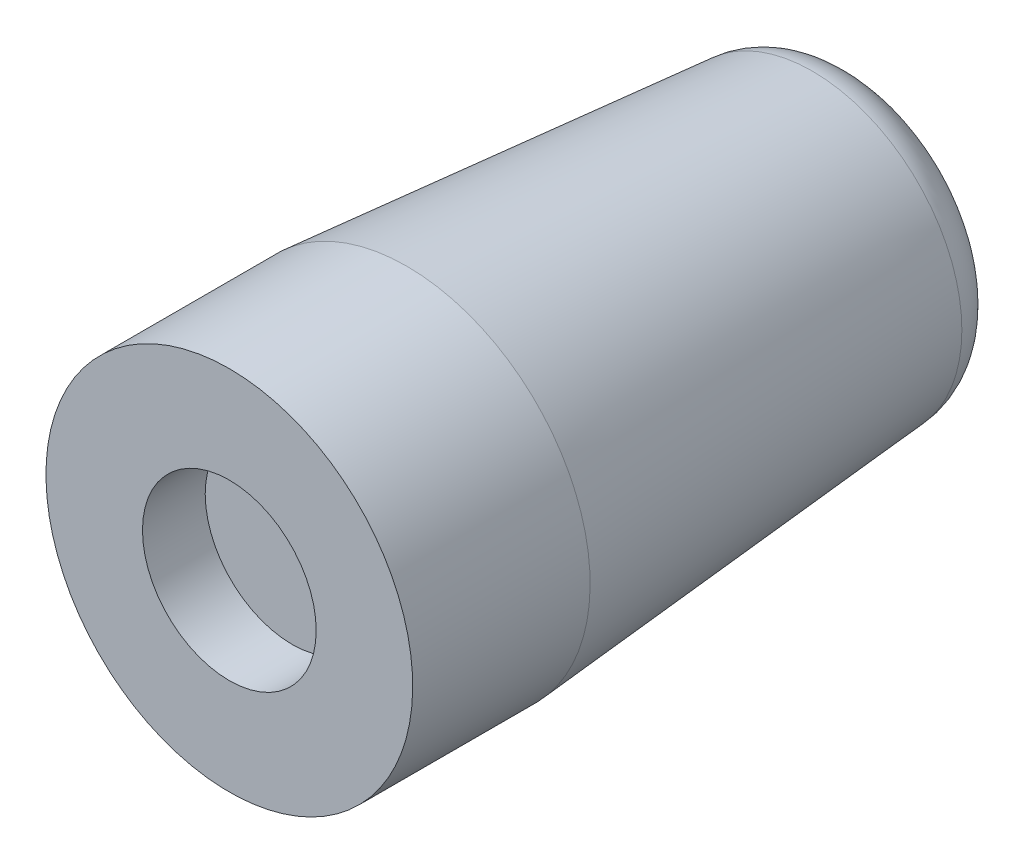
ISO-10303-21;
HEADER;
FILE_DESCRIPTION(('STEP AP214'),'2;1');
FILE_NAME('part.step','',(''),(''),'','','');
FILE_SCHEMA(('AUTOMOTIVE_DESIGN { 1 0 10303 214 1 1 1 1 }'));
ENDSEC;
DATA;
#1=APPLICATION_CONTEXT('core data for automotive mechanical design processes');
#2=APPLICATION_PROTOCOL_DEFINITION('international standard','automotive_design',2000,#1);
#3=PRODUCT_CONTEXT('',#1,'mechanical');
#4=PRODUCT('Part','Part','',(#3));
#5=PRODUCT_RELATED_PRODUCT_CATEGORY('part','',(#4));
#6=PRODUCT_DEFINITION_FORMATION('','',#4);
#7=PRODUCT_DEFINITION_CONTEXT('part definition',#1,'design');
#8=PRODUCT_DEFINITION('design','',#6,#7);
#9=PRODUCT_DEFINITION_SHAPE('','',#8);
#10=(LENGTH_UNIT() NAMED_UNIT(*) SI_UNIT(.MILLI.,.METRE.));
#11=(NAMED_UNIT(*) PLANE_ANGLE_UNIT() SI_UNIT($,.RADIAN.));
#12=(NAMED_UNIT(*) SI_UNIT($,.STERADIAN.) SOLID_ANGLE_UNIT());
#13=UNCERTAINTY_MEASURE_WITH_UNIT(LENGTH_MEASURE(1.E-05),#10,'distance_accuracy_value','');
#14=(GEOMETRIC_REPRESENTATION_CONTEXT(3) GLOBAL_UNCERTAINTY_ASSIGNED_CONTEXT((#13)) GLOBAL_UNIT_ASSIGNED_CONTEXT((#10,
#11,#12)) REPRESENTATION_CONTEXT('',''));
#15=CARTESIAN_POINT('',(0.,0.,0.));
#16=DIRECTION('',(0.,0.,1.));
#17=DIRECTION('',(1.,0.,0.));
#18=AXIS2_PLACEMENT_3D('',#15,#16,#17);
#19=CARTESIAN_POINT('',(0.,0.,-6.18668763642325));
#20=DIRECTION('',(0.,0.,1.));
#21=DIRECTION('',(0.,-1.,0.));
#22=AXIS2_PLACEMENT_3D('',#19,#20,#21);
#23=CONICAL_SURFACE('',#22,3.02056075976579,0.0834087763190236);
#24=CARTESIAN_POINT('',(0.,0.,-5.26999973356904));
#25=DIRECTION('',(0.,0.,-1.));
#26=DIRECTION('',(0.,1.,0.));
#27=AXIS2_PLACEMENT_3D('',#24,#25,#26);
#28=CIRCLE('',#27,3.09719838174993);
#29=CARTESIAN_POINT('',(0.,3.09719838174993,-5.26999973356904));
#30=VERTEX_POINT('',#29);
#31=EDGE_CURVE('E38',#30,#30,#28,.F.);
#32=ORIENTED_EDGE('',*,*,#31,.T.);
#33=EDGE_LOOP('',(#32));
#34=FACE_BOUND('',#33,.T.);
#35=CARTESIAN_POINT('',(0.,0.,3.13644249254123));
#36=DIRECTION('',(0.,0.,-1.));
#37=DIRECTION('',(0.,1.,0.));
#38=AXIS2_PLACEMENT_3D('',#35,#36,#37);
#39=CIRCLE('',#38,3.8);
#40=CARTESIAN_POINT('',(0.,3.8,3.13644249254123));
#41=VERTEX_POINT('',#40);
#42=EDGE_CURVE('E51',#41,#41,#39,.T.);
#43=ORIENTED_EDGE('',*,*,#42,.T.);
#44=EDGE_LOOP('',(#43));
#45=FACE_BOUND('',#44,.T.);
#46=ADVANCED_FACE('F31',(#34,#45),#23,.T.);
#47=CARTESIAN_POINT('',(0.,3.02056075976579,-6.18668763642325));
#48=DIRECTION('',(0.,0.,-1.));
#49=DIRECTION('',(0.,1.,0.));
#50=AXIS2_PLACEMENT_3D('',#47,#48,#49);
#51=PLANE('',#50);
#52=CARTESIAN_POINT('',(0.,0.,-6.18668763642325));
#53=DIRECTION('',(0.,0.,-1.));
#54=DIRECTION('',(0.,1.,0.));
#55=AXIS2_PLACEMENT_3D('',#52,#53,#54);
#56=CIRCLE('',#55,1.69398881417059);
#57=CARTESIAN_POINT('',(0.,1.69398881417059,-6.18668763642325));
#58=VERTEX_POINT('',#57);
#59=EDGE_CURVE('E58',#58,#58,#56,.T.);
#60=ORIENTED_EDGE('',*,*,#59,.F.);
#61=EDGE_LOOP('',(#60));
#62=FACE_BOUND('',#61,.T.);
#63=CARTESIAN_POINT('',(0.,0.,-6.18668763642325));
#64=DIRECTION('',(0.,0.,-1.));
#65=DIRECTION('',(0.,1.,0.));
#66=AXIS2_PLACEMENT_3D('',#63,#64,#65);
#67=CIRCLE('',#66,2.10067487752679);
#68=CARTESIAN_POINT('',(0.,2.10067487752679,-6.18668763642325));
#69=VERTEX_POINT('',#68);
#70=EDGE_CURVE('E42',#69,#69,#67,.T.);
#71=ORIENTED_EDGE('',*,*,#70,.T.);
#72=EDGE_LOOP('',(#71));
#73=FACE_BOUND('',#72,.T.);
#74=ADVANCED_FACE('F66',(#62,#73),#51,.T.);
#75=CARTESIAN_POINT('',(0.,0.,6.81331236357675));
#76=DIRECTION('',(0.,0.,1.));
#77=DIRECTION('',(0.,-1.,0.));
#78=AXIS2_PLACEMENT_3D('',#75,#76,#77);
#79=PLANE('',#78);
#80=CARTESIAN_POINT('',(0.,0.,6.81331236357675));
#81=DIRECTION('',(0.,0.,1.));
#82=DIRECTION('',(1.,0.,0.));
#83=AXIS2_PLACEMENT_3D('',#80,#81,#82);
#84=CIRCLE('',#83,1.8);
#85=CARTESIAN_POINT('',(1.8,0.,6.81331236357675));
#86=VERTEX_POINT('',#85);
#87=EDGE_CURVE('E55',#86,#86,#84,.T.);
#88=ORIENTED_EDGE('',*,*,#87,.F.);
#89=EDGE_LOOP('',(#88));
#90=FACE_BOUND('',#89,.T.);
#91=CARTESIAN_POINT('',(0.,0.,6.81331236357676));
#92=DIRECTION('',(0.,0.,-1.));
#93=DIRECTION('',(0.,1.,0.));
#94=AXIS2_PLACEMENT_3D('',#91,#92,#93);
#95=CIRCLE('',#94,3.8);
#96=CARTESIAN_POINT('',(0.,3.8,6.81331236357676));
#97=VERTEX_POINT('',#96);
#98=EDGE_CURVE('E46',#97,#97,#95,.T.);
#99=ORIENTED_EDGE('',*,*,#98,.F.);
#100=EDGE_LOOP('',(#99));
#101=FACE_BOUND('',#100,.T.);
#102=ADVANCED_FACE('F69',(#90,#101),#79,.T.);
#103=CARTESIAN_POINT('',(0.,0.,-6.35228697687087));
#104=DIRECTION('',(0.,0.,-1.));
#105=DIRECTION('',(0.,1.,0.));
#106=AXIS2_PLACEMENT_3D('',#103,#104,#105);
#107=CYLINDRICAL_SURFACE('',#106,3.8);
#108=ORIENTED_EDGE('',*,*,#98,.T.);
#109=EDGE_LOOP('',(#108));
#110=FACE_BOUND('',#109,.T.);
#111=ORIENTED_EDGE('',*,*,#42,.F.);
#112=EDGE_LOOP('',(#111));
#113=FACE_BOUND('',#112,.T.);
#114=ADVANCED_FACE('F94',(#110,#113),#107,.T.);
#115=CARTESIAN_POINT('',(0.,0.,5.51331236357675));
#116=DIRECTION('',(0.,0.,1.));
#117=DIRECTION('',(1.,0.,0.));
#118=AXIS2_PLACEMENT_3D('',#115,#116,#117);
#119=CYLINDRICAL_SURFACE('',#118,1.8);
#120=CARTESIAN_POINT('',(0.,0.,5.51331236357675));
#121=DIRECTION('',(0.,0.,1.));
#122=DIRECTION('',(1.,0.,0.));
#123=AXIS2_PLACEMENT_3D('',#120,#121,#122);
#124=CIRCLE('',#123,1.8);
#125=CARTESIAN_POINT('',(1.8,0.,5.51331236357675));
#126=VERTEX_POINT('',#125);
#127=EDGE_CURVE('E54',#126,#126,#124,.T.);
#128=ORIENTED_EDGE('',*,*,#127,.F.);
#129=EDGE_LOOP('',(#128));
#130=FACE_BOUND('',#129,.T.);
#131=ORIENTED_EDGE('',*,*,#87,.T.);
#132=EDGE_LOOP('',(#131));
#133=FACE_BOUND('',#132,.T.);
#134=ADVANCED_FACE('F83',(#130,#133),#119,.F.);
#135=CARTESIAN_POINT('',(0.,0.,5.51331236357675));
#136=DIRECTION('',(0.,0.,1.));
#137=DIRECTION('',(1.,0.,0.));
#138=AXIS2_PLACEMENT_3D('',#135,#136,#137);
#139=PLANE('',#138);
#140=ORIENTED_EDGE('',*,*,#127,.T.);
#141=EDGE_LOOP('',(#140));
#142=FACE_BOUND('',#141,.T.);
#143=ADVANCED_FACE('F76',(#142),#139,.T.);
#144=CARTESIAN_POINT('',(0.,0.,-5.18668763642325));
#145=DIRECTION('',(0.,0.,-1.));
#146=DIRECTION('',(0.,1.,0.));
#147=AXIS2_PLACEMENT_3D('',#144,#145,#146);
#148=TOROIDAL_SURFACE('',#147,2.10067487752679,1.);
#149=ORIENTED_EDGE('',*,*,#31,.F.);
#150=EDGE_LOOP('',(#149));
#151=FACE_BOUND('',#150,.T.);
#152=ORIENTED_EDGE('',*,*,#70,.F.);
#153=EDGE_LOOP('',(#152));
#154=FACE_BOUND('',#153,.T.);
#155=ADVANCED_FACE('F73',(#151,#154),#148,.T.);
#156=CARTESIAN_POINT('',(0.,0.,-5.68668763642324));
#157=DIRECTION('',(0.,0.,-1.));
#158=DIRECTION('',(0.,1.,0.));
#159=AXIS2_PLACEMENT_3D('',#156,#157,#158);
#160=PLANE('',#159);
#161=CARTESIAN_POINT('',(0.,0.,-5.68668763642324));
#162=DIRECTION('',(0.,0.,-1.));
#163=DIRECTION('',(0.,1.,0.));
#164=AXIS2_PLACEMENT_3D('',#161,#162,#163);
#165=CIRCLE('',#164,0.827963410386155);
#166=CARTESIAN_POINT('',(0.,0.827963410386155,-5.68668763642324));
#167=VERTEX_POINT('',#166);
#168=EDGE_CURVE('E10',#167,#167,#165,.T.);
#169=ORIENTED_EDGE('',*,*,#168,.T.);
#170=EDGE_LOOP('',(#169));
#171=FACE_BOUND('',#170,.T.);
#172=ADVANCED_FACE('F75',(#171),#160,.T.);
#173=CARTESIAN_POINT('',(0.,0.,-6.68668763642324));
#174=DIRECTION('',(0.,0.,1.));
#175=DIRECTION('',(0.,-1.,0.));
#176=AXIS2_PLACEMENT_3D('',#173,#174,#175);
#177=DEGENERATE_TOROIDAL_SURFACE('',#176,0.827963410386155,1.,.T.);
#178=ORIENTED_EDGE('',*,*,#59,.T.);
#179=EDGE_LOOP('',(#178));
#180=FACE_BOUND('',#179,.T.);
#181=ORIENTED_EDGE('',*,*,#168,.F.);
#182=EDGE_LOOP('',(#181));
#183=FACE_BOUND('',#182,.T.);
#184=ADVANCED_FACE('F33',(#180,#183),#177,.F.);
#185=CLOSED_SHELL('',(#46,#74,#102,#114,#134,#143,#155,#172,#184));
#186=MANIFOLD_SOLID_BREP('B2',#185);
#187=ADVANCED_BREP_SHAPE_REPRESENTATION('',(#18,#186),#14);
#188=SHAPE_DEFINITION_REPRESENTATION(#9,#187);
ENDSEC;
END-ISO-10303-21;
